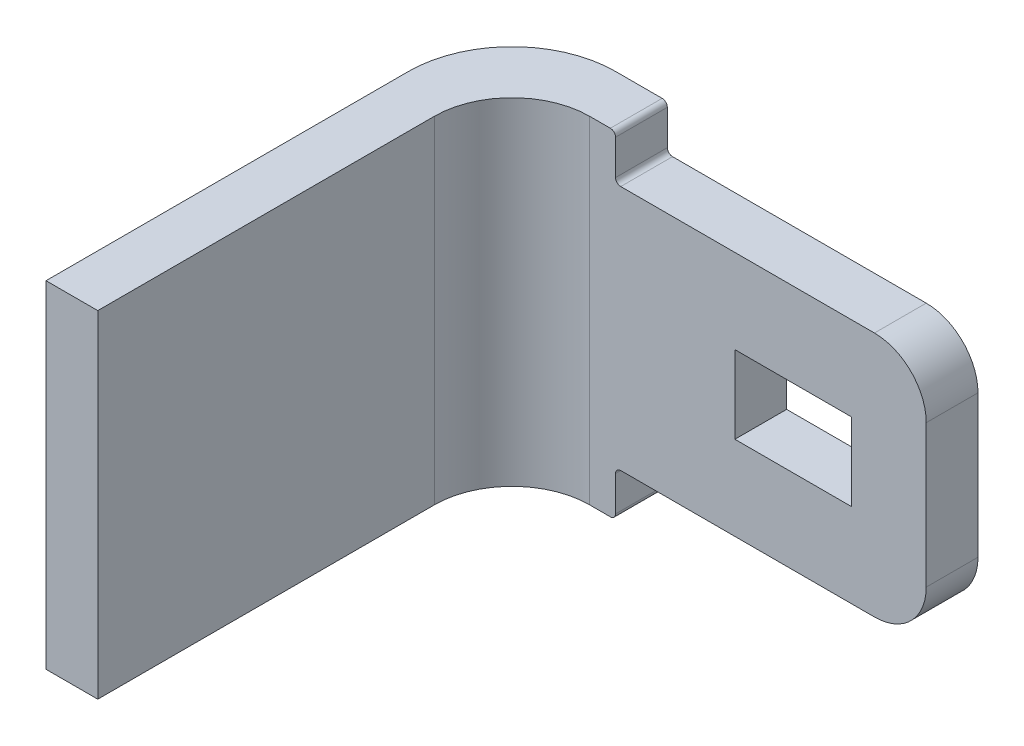
ISO-10303-21;
HEADER;
FILE_DESCRIPTION(('STEP AP214'),'2;1');
FILE_NAME('part.step','',(''),(''),'','','');
FILE_SCHEMA(('AUTOMOTIVE_DESIGN { 1 0 10303 214 1 1 1 1 }'));
ENDSEC;
DATA;
#1=APPLICATION_CONTEXT('core data for automotive mechanical design processes');
#2=APPLICATION_PROTOCOL_DEFINITION('international standard','automotive_design',2000,#1);
#3=PRODUCT_CONTEXT('',#1,'mechanical');
#4=PRODUCT('Part','Part','',(#3));
#5=PRODUCT_RELATED_PRODUCT_CATEGORY('part','',(#4));
#6=PRODUCT_DEFINITION_FORMATION('','',#4);
#7=PRODUCT_DEFINITION_CONTEXT('part definition',#1,'design');
#8=PRODUCT_DEFINITION('design','',#6,#7);
#9=PRODUCT_DEFINITION_SHAPE('','',#8);
#10=(LENGTH_UNIT() NAMED_UNIT(*) SI_UNIT(.MILLI.,.METRE.));
#11=(NAMED_UNIT(*) PLANE_ANGLE_UNIT() SI_UNIT($,.RADIAN.));
#12=(NAMED_UNIT(*) SI_UNIT($,.STERADIAN.) SOLID_ANGLE_UNIT());
#13=UNCERTAINTY_MEASURE_WITH_UNIT(LENGTH_MEASURE(1.E-05),#10,'distance_accuracy_value','');
#14=(GEOMETRIC_REPRESENTATION_CONTEXT(3) GLOBAL_UNCERTAINTY_ASSIGNED_CONTEXT((#13)) GLOBAL_UNIT_ASSIGNED_CONTEXT((#10,
#11,#12)) REPRESENTATION_CONTEXT('',''));
#15=CARTESIAN_POINT('',(0.,0.,0.));
#16=DIRECTION('',(0.,0.,1.));
#17=DIRECTION('',(1.,0.,0.));
#18=AXIS2_PLACEMENT_3D('',#15,#16,#17);
#19=CARTESIAN_POINT('',(-22.7024644194488,6.5,-9.));
#20=DIRECTION('',(1.,0.,0.));
#21=DIRECTION('',(0.,0.,-1.));
#22=AXIS2_PLACEMENT_3D('',#19,#20,#21);
#23=PLANE('',#22);
#24=DIRECTION('',(0.,0.,1.));
#25=VECTOR('',#24,1.);
#26=CARTESIAN_POINT('',(-22.7024644194488,6.5,-9.));
#27=LINE('',#26,#25);
#28=CARTESIAN_POINT('',(-22.7024644194488,6.5,-7.));
#29=VERTEX_POINT('',#28);
#30=CARTESIAN_POINT('',(-22.7024644194488,6.5,0.));
#31=VERTEX_POINT('',#30);
#32=EDGE_CURVE('E241',#29,#31,#27,.T.);
#33=ORIENTED_EDGE('',*,*,#32,.F.);
#34=DIRECTION('',(0.,-1.,0.));
#35=VECTOR('',#34,1.);
#36=CARTESIAN_POINT('',(-22.7024644194488,6.5,-7.));
#37=LINE('',#36,#35);
#38=CARTESIAN_POINT('',(-22.7024644194488,0.,-7.));
#39=VERTEX_POINT('',#38);
#40=EDGE_CURVE('E276',#29,#39,#37,.T.);
#41=ORIENTED_EDGE('',*,*,#40,.T.);
#42=DIRECTION('',(0.,0.,1.));
#43=VECTOR('',#42,1.);
#44=CARTESIAN_POINT('',(-22.7024644194488,0.,-9.));
#45=LINE('',#44,#43);
#46=CARTESIAN_POINT('',(-22.7024644194488,0.,0.));
#47=VERTEX_POINT('',#46);
#48=EDGE_CURVE('E240',#39,#47,#45,.T.);
#49=ORIENTED_EDGE('',*,*,#48,.T.);
#50=DIRECTION('',(0.,-1.,0.));
#51=VECTOR('',#50,1.);
#52=CARTESIAN_POINT('',(-22.7024644194488,6.5,0.));
#53=LINE('',#52,#51);
#54=EDGE_CURVE('E273',#31,#47,#53,.T.);
#55=ORIENTED_EDGE('',*,*,#54,.F.);
#56=EDGE_LOOP('',(#33,#41,#49,#55));
#57=FACE_BOUND('',#56,.T.);
#58=ADVANCED_FACE('F35',(#57),#23,.F.);
#59=CARTESIAN_POINT('',(-22.7024644194488,6.5,0.));
#60=DIRECTION('',(0.,0.,-1.));
#61=DIRECTION('',(-1.,0.,0.));
#62=AXIS2_PLACEMENT_3D('',#59,#60,#61);
#63=PLANE('',#62);
#64=DIRECTION('',(1.,0.,0.));
#65=VECTOR('',#64,1.);
#66=CARTESIAN_POINT('',(-22.7024644194488,0.,0.));
#67=LINE('',#66,#65);
#68=CARTESIAN_POINT('',(-21.7024644194488,0.,0.));
#69=VERTEX_POINT('',#68);
#70=EDGE_CURVE('E256',#47,#69,#67,.T.);
#71=ORIENTED_EDGE('',*,*,#70,.T.);
#72=DIRECTION('',(0.,-1.,0.));
#73=VECTOR('',#72,1.);
#74=CARTESIAN_POINT('',(-21.7024644194488,6.5,0.));
#75=LINE('',#74,#73);
#76=CARTESIAN_POINT('',(-21.7024644194488,6.5,0.));
#77=VERTEX_POINT('',#76);
#78=EDGE_CURVE('E270',#77,#69,#75,.T.);
#79=ORIENTED_EDGE('',*,*,#78,.F.);
#80=DIRECTION('',(1.,0.,0.));
#81=VECTOR('',#80,1.);
#82=CARTESIAN_POINT('',(-22.7024644194488,6.5,0.));
#83=LINE('',#82,#81);
#84=EDGE_CURVE('E243',#31,#77,#83,.T.);
#85=ORIENTED_EDGE('',*,*,#84,.F.);
#86=ORIENTED_EDGE('',*,*,#54,.T.);
#87=EDGE_LOOP('',(#71,#79,#85,#86));
#88=FACE_BOUND('',#87,.T.);
#89=ADVANCED_FACE('F427',(#88),#63,.F.);
#90=CARTESIAN_POINT('',(-21.7024644194488,6.5,0.));
#91=DIRECTION('',(-1.,0.,0.));
#92=DIRECTION('',(0.,0.,1.));
#93=AXIS2_PLACEMENT_3D('',#90,#91,#92);
#94=PLANE('',#93);
#95=DIRECTION('',(0.,0.,-1.));
#96=VECTOR('',#95,1.);
#97=CARTESIAN_POINT('',(-21.7024644194488,0.,0.));
#98=LINE('',#97,#96);
#99=CARTESIAN_POINT('',(-21.7024644194488,0.,-6.50000000000001));
#100=VERTEX_POINT('',#99);
#101=EDGE_CURVE('E258',#69,#100,#98,.T.);
#102=ORIENTED_EDGE('',*,*,#101,.T.);
#103=DIRECTION('',(0.,-1.,0.));
#104=VECTOR('',#103,1.);
#105=CARTESIAN_POINT('',(-21.7024644194488,6.5,-6.50000000000001));
#106=LINE('',#105,#104);
#107=CARTESIAN_POINT('',(-21.7024644194488,6.5,-6.50000000000001));
#108=VERTEX_POINT('',#107);
#109=EDGE_CURVE('E290',#100,#108,#106,.F.);
#110=ORIENTED_EDGE('',*,*,#109,.T.);
#111=DIRECTION('',(0.,0.,-1.));
#112=VECTOR('',#111,1.);
#113=CARTESIAN_POINT('',(-21.7024644194488,6.5,0.));
#114=LINE('',#113,#112);
#115=EDGE_CURVE('E246',#77,#108,#114,.T.);
#116=ORIENTED_EDGE('',*,*,#115,.F.);
#117=ORIENTED_EDGE('',*,*,#78,.T.);
#118=EDGE_LOOP('',(#102,#110,#116,#117));
#119=FACE_BOUND('',#118,.T.);
#120=ADVANCED_FACE('F430',(#119),#94,.F.);
#121=CARTESIAN_POINT('',(-21.7024644194488,6.5,-8.00000000000001));
#122=DIRECTION('',(0.,0.,-1.));
#123=DIRECTION('',(-1.,0.,0.));
#124=AXIS2_PLACEMENT_3D('',#121,#122,#123);
#125=PLANE('',#124);
#126=DIRECTION('',(1.,0.,0.));
#127=VECTOR('',#126,1.);
#128=CARTESIAN_POINT('',(-21.7024644194488,4.,-8.00000000000001));
#129=LINE('',#128,#127);
#130=CARTESIAN_POINT('',(-17.3980030466757,4.,-8.00000000000001));
#131=VERTEX_POINT('',#130);
#132=CARTESIAN_POINT('',(-15.1480030466757,4.,-8.00000000000001));
#133=VERTEX_POINT('',#132);
#134=EDGE_CURVE('E214',#131,#133,#129,.T.);
#135=ORIENTED_EDGE('',*,*,#134,.T.);
#136=DIRECTION('',(0.,-1.,0.));
#137=VECTOR('',#136,1.);
#138=CARTESIAN_POINT('',(-15.1480030466757,6.5,-8.00000000000001));
#139=LINE('',#138,#137);
#140=CARTESIAN_POINT('',(-15.1480030466757,2.5,-8.00000000000001));
#141=VERTEX_POINT('',#140);
#142=EDGE_CURVE('E217',#133,#141,#139,.T.);
#143=ORIENTED_EDGE('',*,*,#142,.T.);
#144=DIRECTION('',(-1.,0.,0.));
#145=VECTOR('',#144,1.);
#146=CARTESIAN_POINT('',(-21.7024644194488,2.5,-8.00000000000001));
#147=LINE('',#146,#145);
#148=CARTESIAN_POINT('',(-17.3980030466758,2.5,-8.00000000000001));
#149=VERTEX_POINT('',#148);
#150=EDGE_CURVE('E209',#141,#149,#147,.T.);
#151=ORIENTED_EDGE('',*,*,#150,.T.);
#152=DIRECTION('',(0.,1.,0.));
#153=VECTOR('',#152,1.);
#154=CARTESIAN_POINT('',(-17.3980030466757,6.5,-8.00000000000001));
#155=LINE('',#154,#153);
#156=EDGE_CURVE('E189',#149,#131,#155,.T.);
#157=ORIENTED_EDGE('',*,*,#156,.T.);
#158=EDGE_LOOP('',(#135,#143,#151,#157));
#159=FACE_BOUND('',#158,.T.);
#160=DIRECTION('',(-1.,0.,0.));
#161=VECTOR('',#160,1.);
#162=CARTESIAN_POINT('',(-21.7024644194488,5.625,-8.00000000000001));
#163=LINE('',#162,#161);
#164=CARTESIAN_POINT('',(-14.7024644194488,5.625,-8.00000000000001));
#165=VERTEX_POINT('',#164);
#166=CARTESIAN_POINT('',(-19.6024644194488,5.625,-8.00000000000001));
#167=VERTEX_POINT('',#166);
#168=EDGE_CURVE('E227',#165,#167,#163,.T.);
#169=ORIENTED_EDGE('',*,*,#168,.T.);
#170=CARTESIAN_POINT('',(-19.6024644194488,5.725,-8.00000000000001));
#171=DIRECTION('',(0.,0.,-1.));
#172=DIRECTION('',(-1.,0.,0.));
#173=AXIS2_PLACEMENT_3D('',#170,#171,#172);
#174=CIRCLE('',#173,0.1);
#175=CARTESIAN_POINT('',(-19.7024644194488,5.725,-8.00000000000001));
#176=VERTEX_POINT('',#175);
#177=EDGE_CURVE('E11',#167,#176,#174,.T.);
#178=ORIENTED_EDGE('',*,*,#177,.T.);
#179=DIRECTION('',(0.,1.,0.));
#180=VECTOR('',#179,1.);
#181=CARTESIAN_POINT('',(-19.7024644194488,6.5,-8.00000000000001));
#182=LINE('',#181,#180);
#183=CARTESIAN_POINT('',(-19.7024644194488,6.4,-8.00000000000001));
#184=VERTEX_POINT('',#183);
#185=EDGE_CURVE('E225',#176,#184,#182,.T.);
#186=ORIENTED_EDGE('',*,*,#185,.T.);
#187=CARTESIAN_POINT('',(-19.8024644194488,6.4,-8.00000000000001));
#188=DIRECTION('',(0.,0.,-1.));
#189=DIRECTION('',(-1.,0.,0.));
#190=AXIS2_PLACEMENT_3D('',#187,#188,#189);
#191=CIRCLE('',#190,0.1);
#192=CARTESIAN_POINT('',(-19.8024644194488,6.5,-8.00000000000001));
#193=VERTEX_POINT('',#192);
#194=EDGE_CURVE('E321',#184,#193,#191,.F.);
#195=ORIENTED_EDGE('',*,*,#194,.T.);
#196=DIRECTION('',(1.,0.,0.));
#197=VECTOR('',#196,1.);
#198=CARTESIAN_POINT('',(-21.7024644194488,6.5,-8.00000000000001));
#199=LINE('',#198,#197);
#200=CARTESIAN_POINT('',(-20.2024644194488,6.5,-8.00000000000001));
#201=VERTEX_POINT('',#200);
#202=EDGE_CURVE('E249',#201,#193,#199,.T.);
#203=ORIENTED_EDGE('',*,*,#202,.F.);
#204=DIRECTION('',(0.,-1.,0.));
#205=VECTOR('',#204,1.);
#206=CARTESIAN_POINT('',(-20.2024644194488,0.,-8.00000000000001));
#207=LINE('',#206,#205);
#208=CARTESIAN_POINT('',(-20.2024644194488,0.,-8.00000000000001));
#209=VERTEX_POINT('',#208);
#210=EDGE_CURVE('E287',#201,#209,#207,.T.);
#211=ORIENTED_EDGE('',*,*,#210,.T.);
#212=DIRECTION('',(1.,0.,0.));
#213=VECTOR('',#212,1.);
#214=CARTESIAN_POINT('',(-21.7024644194488,0.,-8.00000000000001));
#215=LINE('',#214,#213);
#216=CARTESIAN_POINT('',(-19.8024644194488,0.,-8.00000000000001));
#217=VERTEX_POINT('',#216);
#218=EDGE_CURVE('E261',#209,#217,#215,.T.);
#219=ORIENTED_EDGE('',*,*,#218,.T.);
#220=CARTESIAN_POINT('',(-19.8024644194488,0.1,-8.00000000000001));
#221=DIRECTION('',(0.,0.,-1.));
#222=DIRECTION('',(-1.,0.,0.));
#223=AXIS2_PLACEMENT_3D('',#220,#221,#222);
#224=CIRCLE('',#223,0.1);
#225=CARTESIAN_POINT('',(-19.7024644194488,0.1,-8.00000000000001));
#226=VERTEX_POINT('',#225);
#227=EDGE_CURVE('E319',#217,#226,#224,.F.);
#228=ORIENTED_EDGE('',*,*,#227,.T.);
#229=DIRECTION('',(0.,1.,0.));
#230=VECTOR('',#229,1.);
#231=CARTESIAN_POINT('',(-19.7024644194488,6.5,-8.00000000000001));
#232=LINE('',#231,#230);
#233=CARTESIAN_POINT('',(-19.7024644194488,0.775,-8.00000000000001));
#234=VERTEX_POINT('',#233);
#235=EDGE_CURVE('E235',#226,#234,#232,.T.);
#236=ORIENTED_EDGE('',*,*,#235,.T.);
#237=CARTESIAN_POINT('',(-19.6024644194488,0.775,-8.00000000000001));
#238=DIRECTION('',(0.,0.,-1.));
#239=DIRECTION('',(-1.,0.,0.));
#240=AXIS2_PLACEMENT_3D('',#237,#238,#239);
#241=CIRCLE('',#240,0.1);
#242=CARTESIAN_POINT('',(-19.6024644194488,0.875,-8.00000000000001));
#243=VERTEX_POINT('',#242);
#244=EDGE_CURVE('E347',#234,#243,#241,.T.);
#245=ORIENTED_EDGE('',*,*,#244,.T.);
#246=DIRECTION('',(1.,0.,0.));
#247=VECTOR('',#246,1.);
#248=CARTESIAN_POINT('',(-21.7024644194488,0.875,-8.00000000000001));
#249=LINE('',#248,#247);
#250=CARTESIAN_POINT('',(-14.7024644194488,0.875,-8.00000000000001));
#251=VERTEX_POINT('',#250);
#252=EDGE_CURVE('E238',#243,#251,#249,.T.);
#253=ORIENTED_EDGE('',*,*,#252,.T.);
#254=CARTESIAN_POINT('',(-14.7024644194488,1.875,-8.00000000000001));
#255=DIRECTION('',(0.,0.,-1.));
#256=DIRECTION('',(-1.,0.,0.));
#257=AXIS2_PLACEMENT_3D('',#254,#255,#256);
#258=CIRCLE('',#257,1.);
#259=CARTESIAN_POINT('',(-13.7024644194488,1.875,-8.00000000000001));
#260=VERTEX_POINT('',#259);
#261=EDGE_CURVE('E309',#251,#260,#258,.F.);
#262=ORIENTED_EDGE('',*,*,#261,.T.);
#263=DIRECTION('',(0.,-1.,0.));
#264=VECTOR('',#263,1.);
#265=CARTESIAN_POINT('',(-13.7024644194488,6.5,-8.00000000000001));
#266=LINE('',#265,#264);
#267=CARTESIAN_POINT('',(-13.7024644194488,4.625,-8.00000000000001));
#268=VERTEX_POINT('',#267);
#269=EDGE_CURVE('E267',#268,#260,#266,.T.);
#270=ORIENTED_EDGE('',*,*,#269,.F.);
#271=CARTESIAN_POINT('',(-14.7024644194488,4.625,-8.00000000000001));
#272=DIRECTION('',(0.,0.,-1.));
#273=DIRECTION('',(-1.,0.,0.));
#274=AXIS2_PLACEMENT_3D('',#271,#272,#273);
#275=CIRCLE('',#274,1.);
#276=EDGE_CURVE('E311',#268,#165,#275,.F.);
#277=ORIENTED_EDGE('',*,*,#276,.T.);
#278=EDGE_LOOP('',(#169,#178,#186,#195,#203,#211,#219,#228,#236,#245,#253,#262,#270,#277));
#279=FACE_BOUND('',#278,.T.);
#280=ADVANCED_FACE('F361',(#159,#279),#125,.F.);
#281=CARTESIAN_POINT('',(-13.7024644194488,6.5,-8.00000000000001));
#282=DIRECTION('',(-1.,0.,0.));
#283=DIRECTION('',(0.,0.,1.));
#284=AXIS2_PLACEMENT_3D('',#281,#282,#283);
#285=PLANE('',#284);
#286=DIRECTION('',(0.,-1.,0.));
#287=VECTOR('',#286,1.);
#288=CARTESIAN_POINT('',(-13.7024644194488,6.5,-9.00000000000001));
#289=LINE('',#288,#287);
#290=CARTESIAN_POINT('',(-13.7024644194488,4.625,-9.00000000000001));
#291=VERTEX_POINT('',#290);
#292=CARTESIAN_POINT('',(-13.7024644194488,1.875,-9.00000000000001));
#293=VERTEX_POINT('',#292);
#294=EDGE_CURVE('E254',#291,#293,#289,.T.);
#295=ORIENTED_EDGE('',*,*,#294,.F.);
#296=DIRECTION('',(0.,0.,-1.));
#297=VECTOR('',#296,1.);
#298=CARTESIAN_POINT('',(-13.7024644194488,4.625,-8.00000000000001));
#299=LINE('',#298,#297);
#300=EDGE_CURVE('E307',#291,#268,#299,.F.);
#301=ORIENTED_EDGE('',*,*,#300,.T.);
#302=ORIENTED_EDGE('',*,*,#269,.T.);
#303=DIRECTION('',(0.,0.,-1.));
#304=VECTOR('',#303,1.);
#305=CARTESIAN_POINT('',(-13.7024644194488,1.875,-8.00000000000001));
#306=LINE('',#305,#304);
#307=EDGE_CURVE('E304',#260,#293,#306,.T.);
#308=ORIENTED_EDGE('',*,*,#307,.T.);
#309=EDGE_LOOP('',(#295,#301,#302,#308));
#310=FACE_BOUND('',#309,.T.);
#311=ADVANCED_FACE('F411',(#310),#285,.F.);
#312=CARTESIAN_POINT('',(-13.7024644194488,6.5,-9.00000000000001));
#313=DIRECTION('',(0.,0.,1.));
#314=DIRECTION('',(1.,0.,0.));
#315=AXIS2_PLACEMENT_3D('',#312,#313,#314);
#316=PLANE('',#315);
#317=DIRECTION('',(-1.,0.,0.));
#318=VECTOR('',#317,1.);
#319=CARTESIAN_POINT('',(-15.1480030466757,2.5,-9.00000000000001));
#320=LINE('',#319,#318);
#321=CARTESIAN_POINT('',(-15.1480030466757,2.5,-9.00000000000001));
#322=VERTEX_POINT('',#321);
#323=CARTESIAN_POINT('',(-17.3980030466757,2.5,-9.00000000000001));
#324=VERTEX_POINT('',#323);
#325=EDGE_CURVE('E195',#322,#324,#320,.T.);
#326=ORIENTED_EDGE('',*,*,#325,.F.);
#327=DIRECTION('',(0.,-1.,0.));
#328=VECTOR('',#327,1.);
#329=CARTESIAN_POINT('',(-15.1480030466757,2.5,-9.00000000000001));
#330=LINE('',#329,#328);
#331=CARTESIAN_POINT('',(-15.1480030466757,4.,-9.00000000000001));
#332=VERTEX_POINT('',#331);
#333=EDGE_CURVE('E58',#332,#322,#330,.T.);
#334=ORIENTED_EDGE('',*,*,#333,.F.);
#335=DIRECTION('',(1.,0.,0.));
#336=VECTOR('',#335,1.);
#337=CARTESIAN_POINT('',(-15.1480030466757,4.,-9.00000000000001));
#338=LINE('',#337,#336);
#339=CARTESIAN_POINT('',(-17.3980030466757,4.,-9.00000000000001));
#340=VERTEX_POINT('',#339);
#341=EDGE_CURVE('E202',#340,#332,#338,.T.);
#342=ORIENTED_EDGE('',*,*,#341,.F.);
#343=DIRECTION('',(0.,1.,0.));
#344=VECTOR('',#343,1.);
#345=CARTESIAN_POINT('',(-17.3980030466757,2.5,-9.00000000000001));
#346=LINE('',#345,#344);
#347=EDGE_CURVE('E186',#324,#340,#346,.T.);
#348=ORIENTED_EDGE('',*,*,#347,.F.);
#349=EDGE_LOOP('',(#326,#334,#342,#348));
#350=FACE_BOUND('',#349,.T.);
#351=DIRECTION('',(-1.,0.,0.));
#352=VECTOR('',#351,1.);
#353=CARTESIAN_POINT('',(-13.7024644194488,6.5,-9.00000000000001));
#354=LINE('',#353,#352);
#355=CARTESIAN_POINT('',(-19.8024644194488,6.5,-9.));
#356=VERTEX_POINT('',#355);
#357=CARTESIAN_POINT('',(-20.7024644194488,6.5,-9.));
#358=VERTEX_POINT('',#357);
#359=EDGE_CURVE('E252',#356,#358,#354,.T.);
#360=ORIENTED_EDGE('',*,*,#359,.F.);
#361=CARTESIAN_POINT('',(-19.8024644194488,6.4,-9.));
#362=DIRECTION('',(0.,0.,1.));
#363=DIRECTION('',(1.,0.,0.));
#364=AXIS2_PLACEMENT_3D('',#361,#362,#363);
#365=CIRCLE('',#364,0.1);
#366=CARTESIAN_POINT('',(-19.7024644194488,6.4,-9.));
#367=VERTEX_POINT('',#366);
#368=EDGE_CURVE('E327',#356,#367,#365,.F.);
#369=ORIENTED_EDGE('',*,*,#368,.T.);
#370=DIRECTION('',(0.,1.,0.));
#371=VECTOR('',#370,1.);
#372=CARTESIAN_POINT('',(-19.7024644194488,6.5,-9.));
#373=LINE('',#372,#371);
#374=CARTESIAN_POINT('',(-19.7024644194488,5.725,-9.));
#375=VERTEX_POINT('',#374);
#376=EDGE_CURVE('E223',#375,#367,#373,.T.);
#377=ORIENTED_EDGE('',*,*,#376,.F.);
#378=CARTESIAN_POINT('',(-19.6024644194488,5.725,-9.));
#379=DIRECTION('',(0.,0.,1.));
#380=DIRECTION('',(1.,0.,0.));
#381=AXIS2_PLACEMENT_3D('',#378,#379,#380);
#382=CIRCLE('',#381,0.1);
#383=CARTESIAN_POINT('',(-19.6024644194488,5.625,-9.));
#384=VERTEX_POINT('',#383);
#385=EDGE_CURVE('E43',#375,#384,#382,.T.);
#386=ORIENTED_EDGE('',*,*,#385,.T.);
#387=DIRECTION('',(-1.,0.,0.));
#388=VECTOR('',#387,1.);
#389=CARTESIAN_POINT('',(-13.7024644194488,5.625,-9.00000000000001));
#390=LINE('',#389,#388);
#391=CARTESIAN_POINT('',(-14.7024644194488,5.625,-9.00000000000001));
#392=VERTEX_POINT('',#391);
#393=EDGE_CURVE('E220',#392,#384,#390,.T.);
#394=ORIENTED_EDGE('',*,*,#393,.F.);
#395=CARTESIAN_POINT('',(-14.7024644194488,4.625,-9.00000000000001));
#396=DIRECTION('',(0.,0.,1.));
#397=DIRECTION('',(1.,0.,0.));
#398=AXIS2_PLACEMENT_3D('',#395,#396,#397);
#399=CIRCLE('',#398,1.);
#400=EDGE_CURVE('E302',#392,#291,#399,.F.);
#401=ORIENTED_EDGE('',*,*,#400,.T.);
#402=ORIENTED_EDGE('',*,*,#294,.T.);
#403=CARTESIAN_POINT('',(-14.7024644194488,1.875,-9.00000000000001));
#404=DIRECTION('',(0.,0.,1.));
#405=DIRECTION('',(1.,0.,0.));
#406=AXIS2_PLACEMENT_3D('',#403,#404,#405);
#407=CIRCLE('',#406,1.);
#408=CARTESIAN_POINT('',(-14.7024644194488,0.875,-9.00000000000001));
#409=VERTEX_POINT('',#408);
#410=EDGE_CURVE('E299',#293,#409,#407,.F.);
#411=ORIENTED_EDGE('',*,*,#410,.T.);
#412=DIRECTION('',(1.,0.,0.));
#413=VECTOR('',#412,1.);
#414=CARTESIAN_POINT('',(-13.7024644194488,0.875,-9.00000000000001));
#415=LINE('',#414,#413);
#416=CARTESIAN_POINT('',(-19.6024644194488,0.875,-9.));
#417=VERTEX_POINT('',#416);
#418=EDGE_CURVE('E233',#417,#409,#415,.T.);
#419=ORIENTED_EDGE('',*,*,#418,.F.);
#420=CARTESIAN_POINT('',(-19.6024644194488,0.775,-9.));
#421=DIRECTION('',(0.,0.,1.));
#422=DIRECTION('',(1.,0.,0.));
#423=AXIS2_PLACEMENT_3D('',#420,#421,#422);
#424=CIRCLE('',#423,0.1);
#425=CARTESIAN_POINT('',(-19.7024644194488,0.775,-9.));
#426=VERTEX_POINT('',#425);
#427=EDGE_CURVE('E345',#417,#426,#424,.T.);
#428=ORIENTED_EDGE('',*,*,#427,.T.);
#429=DIRECTION('',(0.,1.,0.));
#430=VECTOR('',#429,1.);
#431=CARTESIAN_POINT('',(-19.7024644194488,0.,-9.));
#432=LINE('',#431,#430);
#433=CARTESIAN_POINT('',(-19.7024644194488,0.1,-9.));
#434=VERTEX_POINT('',#433);
#435=EDGE_CURVE('E230',#434,#426,#432,.T.);
#436=ORIENTED_EDGE('',*,*,#435,.F.);
#437=CARTESIAN_POINT('',(-19.8024644194488,0.1,-9.));
#438=DIRECTION('',(0.,0.,1.));
#439=DIRECTION('',(1.,0.,0.));
#440=AXIS2_PLACEMENT_3D('',#437,#438,#439);
#441=CIRCLE('',#440,0.1);
#442=CARTESIAN_POINT('',(-19.8024644194488,0.,-9.));
#443=VERTEX_POINT('',#442);
#444=EDGE_CURVE('E325',#434,#443,#441,.F.);
#445=ORIENTED_EDGE('',*,*,#444,.T.);
#446=DIRECTION('',(-1.,0.,0.));
#447=VECTOR('',#446,1.);
#448=CARTESIAN_POINT('',(-13.7024644194488,0.,-9.00000000000001));
#449=LINE('',#448,#447);
#450=CARTESIAN_POINT('',(-20.7024644194488,0.,-9.));
#451=VERTEX_POINT('',#450);
#452=EDGE_CURVE('E244',#443,#451,#449,.T.);
#453=ORIENTED_EDGE('',*,*,#452,.T.);
#454=DIRECTION('',(0.,-1.,0.));
#455=VECTOR('',#454,1.);
#456=CARTESIAN_POINT('',(-20.7024644194488,6.5,-9.));
#457=LINE('',#456,#455);
#458=EDGE_CURVE('E282',#451,#358,#457,.F.);
#459=ORIENTED_EDGE('',*,*,#458,.T.);
#460=EDGE_LOOP('',(#360,#369,#377,#386,#394,#401,#402,#411,#419,#428,#436,#445,#453,#459));
#461=FACE_BOUND('',#460,.T.);
#462=ADVANCED_FACE('F199',(#350,#461),#316,.F.);
#463=CARTESIAN_POINT('',(0.,6.5,0.));
#464=DIRECTION('',(0.,1.,0.));
#465=DIRECTION('',(0.,0.,1.));
#466=AXIS2_PLACEMENT_3D('',#463,#464,#465);
#467=PLANE('',#466);
#468=ORIENTED_EDGE('',*,*,#202,.T.);
#469=DIRECTION('',(0.,0.,1.));
#470=VECTOR('',#469,1.);
#471=CARTESIAN_POINT('',(-19.8024644194488,6.5,-9.));
#472=LINE('',#471,#470);
#473=EDGE_CURVE('E323',#193,#356,#472,.F.);
#474=ORIENTED_EDGE('',*,*,#473,.T.);
#475=ORIENTED_EDGE('',*,*,#359,.T.);
#476=CARTESIAN_POINT('',(-20.7024644194488,6.5,-7.));
#477=DIRECTION('',(0.,1.,0.));
#478=DIRECTION('',(0.,0.,1.));
#479=AXIS2_PLACEMENT_3D('',#476,#477,#478);
#480=CIRCLE('',#479,2.);
#481=EDGE_CURVE('E285',#358,#29,#480,.T.);
#482=ORIENTED_EDGE('',*,*,#481,.T.);
#483=ORIENTED_EDGE('',*,*,#32,.T.);
#484=ORIENTED_EDGE('',*,*,#84,.T.);
#485=ORIENTED_EDGE('',*,*,#115,.T.);
#486=CARTESIAN_POINT('',(-20.2024644194488,6.5,-6.50000000000001));
#487=DIRECTION('',(0.,1.,0.));
#488=DIRECTION('',(0.,0.,1.));
#489=AXIS2_PLACEMENT_3D('',#486,#487,#488);
#490=CIRCLE('',#489,1.5);
#491=EDGE_CURVE('E294',#108,#201,#490,.F.);
#492=ORIENTED_EDGE('',*,*,#491,.T.);
#493=EDGE_LOOP('',(#468,#474,#475,#482,#483,#484,#485,#492));
#494=FACE_BOUND('',#493,.T.);
#495=ADVANCED_FACE('F373',(#494),#467,.T.);
#496=CARTESIAN_POINT('',(0.,0.,0.));
#497=DIRECTION('',(0.,1.,0.));
#498=DIRECTION('',(0.,0.,1.));
#499=AXIS2_PLACEMENT_3D('',#496,#497,#498);
#500=PLANE('',#499);
#501=ORIENTED_EDGE('',*,*,#452,.F.);
#502=DIRECTION('',(0.,0.,1.));
#503=VECTOR('',#502,1.);
#504=CARTESIAN_POINT('',(-19.8024644194488,0.,0.));
#505=LINE('',#504,#503);
#506=EDGE_CURVE('E330',#443,#217,#505,.T.);
#507=ORIENTED_EDGE('',*,*,#506,.T.);
#508=ORIENTED_EDGE('',*,*,#218,.F.);
#509=CARTESIAN_POINT('',(-20.2024644194488,0.,-6.50000000000001));
#510=DIRECTION('',(0.,1.,0.));
#511=DIRECTION('',(0.,0.,1.));
#512=AXIS2_PLACEMENT_3D('',#509,#510,#511);
#513=CIRCLE('',#512,1.5);
#514=EDGE_CURVE('E292',#209,#100,#513,.T.);
#515=ORIENTED_EDGE('',*,*,#514,.T.);
#516=ORIENTED_EDGE('',*,*,#101,.F.);
#517=ORIENTED_EDGE('',*,*,#70,.F.);
#518=ORIENTED_EDGE('',*,*,#48,.F.);
#519=CARTESIAN_POINT('',(-20.7024644194488,0.,-7.));
#520=DIRECTION('',(0.,1.,0.));
#521=DIRECTION('',(0.,0.,1.));
#522=AXIS2_PLACEMENT_3D('',#519,#520,#521);
#523=CIRCLE('',#522,2.);
#524=EDGE_CURVE('E279',#39,#451,#523,.F.);
#525=ORIENTED_EDGE('',*,*,#524,.T.);
#526=EDGE_LOOP('',(#501,#507,#508,#515,#516,#517,#518,#525));
#527=FACE_BOUND('',#526,.T.);
#528=ADVANCED_FACE('F382',(#527),#500,.F.);
#529=CARTESIAN_POINT('',(-20.7024644194488,6.5,-7.));
#530=DIRECTION('',(0.,-1.,0.));
#531=DIRECTION('',(0.,0.,-1.));
#532=AXIS2_PLACEMENT_3D('',#529,#530,#531);
#533=CYLINDRICAL_SURFACE('',#532,2.);
#534=ORIENTED_EDGE('',*,*,#481,.F.);
#535=ORIENTED_EDGE('',*,*,#458,.F.);
#536=ORIENTED_EDGE('',*,*,#524,.F.);
#537=ORIENTED_EDGE('',*,*,#40,.F.);
#538=EDGE_LOOP('',(#534,#535,#536,#537));
#539=FACE_BOUND('',#538,.T.);
#540=ADVANCED_FACE('F421',(#539),#533,.T.);
#541=CARTESIAN_POINT('',(-20.2024644194488,6.5,-6.50000000000001));
#542=DIRECTION('',(0.,1.,0.));
#543=DIRECTION('',(0.,0.,1.));
#544=AXIS2_PLACEMENT_3D('',#541,#542,#543);
#545=CYLINDRICAL_SURFACE('',#544,1.5);
#546=ORIENTED_EDGE('',*,*,#491,.F.);
#547=ORIENTED_EDGE('',*,*,#109,.F.);
#548=ORIENTED_EDGE('',*,*,#514,.F.);
#549=ORIENTED_EDGE('',*,*,#210,.F.);
#550=EDGE_LOOP('',(#546,#547,#548,#549));
#551=FACE_BOUND('',#550,.T.);
#552=ADVANCED_FACE('F378',(#551),#545,.F.);
#553=CARTESIAN_POINT('',(-13.7024644194488,0.875,0.));
#554=DIRECTION('',(0.,1.,0.));
#555=DIRECTION('',(-1.,0.,0.));
#556=AXIS2_PLACEMENT_3D('',#553,#554,#555);
#557=PLANE('',#556);
#558=ORIENTED_EDGE('',*,*,#252,.F.);
#559=DIRECTION('',(0.,0.,-1.));
#560=VECTOR('',#559,1.);
#561=CARTESIAN_POINT('',(-19.6024644194488,0.875,-9.));
#562=LINE('',#561,#560);
#563=EDGE_CURVE('E335',#243,#417,#562,.T.);
#564=ORIENTED_EDGE('',*,*,#563,.T.);
#565=ORIENTED_EDGE('',*,*,#418,.T.);
#566=DIRECTION('',(0.,0.,-1.));
#567=VECTOR('',#566,1.);
#568=CARTESIAN_POINT('',(-14.7024644194488,0.875,0.));
#569=LINE('',#568,#567);
#570=EDGE_CURVE('E313',#409,#251,#569,.F.);
#571=ORIENTED_EDGE('',*,*,#570,.T.);
#572=EDGE_LOOP('',(#558,#564,#565,#571));
#573=FACE_BOUND('',#572,.T.);
#574=ADVANCED_FACE('F400',(#573),#557,.F.);
#575=CARTESIAN_POINT('',(-19.7024644194488,0.,0.));
#576=DIRECTION('',(-1.,0.,0.));
#577=DIRECTION('',(0.,0.,1.));
#578=AXIS2_PLACEMENT_3D('',#575,#576,#577);
#579=PLANE('',#578);
#580=ORIENTED_EDGE('',*,*,#435,.T.);
#581=DIRECTION('',(0.,0.,-1.));
#582=VECTOR('',#581,1.);
#583=CARTESIAN_POINT('',(-19.7024644194488,0.775,-8.00000000000001));
#584=LINE('',#583,#582);
#585=EDGE_CURVE('E338',#426,#234,#584,.F.);
#586=ORIENTED_EDGE('',*,*,#585,.T.);
#587=ORIENTED_EDGE('',*,*,#235,.F.);
#588=DIRECTION('',(0.,0.,1.));
#589=VECTOR('',#588,1.);
#590=CARTESIAN_POINT('',(-19.7024644194488,0.1,0.));
#591=LINE('',#590,#589);
#592=EDGE_CURVE('E333',#226,#434,#591,.F.);
#593=ORIENTED_EDGE('',*,*,#592,.T.);
#594=EDGE_LOOP('',(#580,#586,#587,#593));
#595=FACE_BOUND('',#594,.T.);
#596=ADVANCED_FACE('F392',(#595),#579,.F.);
#597=CARTESIAN_POINT('',(-13.7024644194488,5.625,0.));
#598=DIRECTION('',(0.,-1.,0.));
#599=DIRECTION('',(0.,0.,-1.));
#600=AXIS2_PLACEMENT_3D('',#597,#598,#599);
#601=PLANE('',#600);
#602=ORIENTED_EDGE('',*,*,#393,.T.);
#603=DIRECTION('',(0.,0.,-1.));
#604=VECTOR('',#603,1.);
#605=CARTESIAN_POINT('',(-19.6024644194488,5.625,-8.00000000000001));
#606=LINE('',#605,#604);
#607=EDGE_CURVE('E343',#384,#167,#606,.F.);
#608=ORIENTED_EDGE('',*,*,#607,.T.);
#609=ORIENTED_EDGE('',*,*,#168,.F.);
#610=DIRECTION('',(0.,0.,-1.));
#611=VECTOR('',#610,1.);
#612=CARTESIAN_POINT('',(-14.7024644194488,5.625,0.));
#613=LINE('',#612,#611);
#614=EDGE_CURVE('E296',#165,#392,#613,.T.);
#615=ORIENTED_EDGE('',*,*,#614,.T.);
#616=EDGE_LOOP('',(#602,#608,#609,#615));
#617=FACE_BOUND('',#616,.T.);
#618=ADVANCED_FACE('F355',(#617),#601,.F.);
#619=CARTESIAN_POINT('',(-19.7024644194488,6.5,0.));
#620=DIRECTION('',(-1.,0.,0.));
#621=DIRECTION('',(0.,0.,1.));
#622=AXIS2_PLACEMENT_3D('',#619,#620,#621);
#623=PLANE('',#622);
#624=ORIENTED_EDGE('',*,*,#185,.F.);
#625=DIRECTION('',(0.,0.,-1.));
#626=VECTOR('',#625,1.);
#627=CARTESIAN_POINT('',(-19.7024644194488,5.725,-9.));
#628=LINE('',#627,#626);
#629=EDGE_CURVE('E340',#176,#375,#628,.T.);
#630=ORIENTED_EDGE('',*,*,#629,.T.);
#631=ORIENTED_EDGE('',*,*,#376,.T.);
#632=DIRECTION('',(0.,0.,1.));
#633=VECTOR('',#632,1.);
#634=CARTESIAN_POINT('',(-19.7024644194488,6.4,-8.00000000000001));
#635=LINE('',#634,#633);
#636=EDGE_CURVE('E316',#367,#184,#635,.T.);
#637=ORIENTED_EDGE('',*,*,#636,.T.);
#638=EDGE_LOOP('',(#624,#630,#631,#637));
#639=FACE_BOUND('',#638,.T.);
#640=ADVANCED_FACE('F364',(#639),#623,.F.);
#641=CARTESIAN_POINT('',(-14.7024644194488,4.625,0.));
#642=DIRECTION('',(0.,0.,-1.));
#643=DIRECTION('',(-1.,0.,0.));
#644=AXIS2_PLACEMENT_3D('',#641,#642,#643);
#645=CYLINDRICAL_SURFACE('',#644,1.);
#646=ORIENTED_EDGE('',*,*,#276,.F.);
#647=ORIENTED_EDGE('',*,*,#300,.F.);
#648=ORIENTED_EDGE('',*,*,#400,.F.);
#649=ORIENTED_EDGE('',*,*,#614,.F.);
#650=EDGE_LOOP('',(#646,#647,#648,#649));
#651=FACE_BOUND('',#650,.T.);
#652=ADVANCED_FACE('F414',(#651),#645,.T.);
#653=CARTESIAN_POINT('',(-14.7024644194488,1.875,-8.00000000000001));
#654=DIRECTION('',(0.,0.,-1.));
#655=DIRECTION('',(-1.,0.,0.));
#656=AXIS2_PLACEMENT_3D('',#653,#654,#655);
#657=CYLINDRICAL_SURFACE('',#656,1.);
#658=ORIENTED_EDGE('',*,*,#261,.F.);
#659=ORIENTED_EDGE('',*,*,#570,.F.);
#660=ORIENTED_EDGE('',*,*,#410,.F.);
#661=ORIENTED_EDGE('',*,*,#307,.F.);
#662=EDGE_LOOP('',(#658,#659,#660,#661));
#663=FACE_BOUND('',#662,.T.);
#664=ADVANCED_FACE('F406',(#663),#657,.T.);
#665=CARTESIAN_POINT('',(-19.8024644194488,6.4,0.));
#666=DIRECTION('',(0.,0.,-1.));
#667=DIRECTION('',(-1.,0.,0.));
#668=AXIS2_PLACEMENT_3D('',#665,#666,#667);
#669=CYLINDRICAL_SURFACE('',#668,0.1);
#670=ORIENTED_EDGE('',*,*,#368,.F.);
#671=ORIENTED_EDGE('',*,*,#473,.F.);
#672=ORIENTED_EDGE('',*,*,#194,.F.);
#673=ORIENTED_EDGE('',*,*,#636,.F.);
#674=EDGE_LOOP('',(#670,#671,#672,#673));
#675=FACE_BOUND('',#674,.T.);
#676=ADVANCED_FACE('F368',(#675),#669,.T.);
#677=CARTESIAN_POINT('',(-19.8024644194488,0.1,0.));
#678=DIRECTION('',(0.,0.,1.));
#679=DIRECTION('',(1.,0.,0.));
#680=AXIS2_PLACEMENT_3D('',#677,#678,#679);
#681=CYLINDRICAL_SURFACE('',#680,0.1);
#682=ORIENTED_EDGE('',*,*,#444,.F.);
#683=ORIENTED_EDGE('',*,*,#592,.F.);
#684=ORIENTED_EDGE('',*,*,#227,.F.);
#685=ORIENTED_EDGE('',*,*,#506,.F.);
#686=EDGE_LOOP('',(#682,#683,#684,#685));
#687=FACE_BOUND('',#686,.T.);
#688=ADVANCED_FACE('F387',(#687),#681,.T.);
#689=CARTESIAN_POINT('',(-19.6024644194488,0.775,0.));
#690=DIRECTION('',(0.,0.,1.));
#691=DIRECTION('',(1.,0.,0.));
#692=AXIS2_PLACEMENT_3D('',#689,#690,#691);
#693=CYLINDRICAL_SURFACE('',#692,0.1);
#694=ORIENTED_EDGE('',*,*,#244,.F.);
#695=ORIENTED_EDGE('',*,*,#585,.F.);
#696=ORIENTED_EDGE('',*,*,#427,.F.);
#697=ORIENTED_EDGE('',*,*,#563,.F.);
#698=EDGE_LOOP('',(#694,#695,#696,#697));
#699=FACE_BOUND('',#698,.T.);
#700=ADVANCED_FACE('F396',(#699),#693,.F.);
#701=CARTESIAN_POINT('',(-19.6024644194488,5.725,0.));
#702=DIRECTION('',(0.,0.,1.));
#703=DIRECTION('',(1.,0.,0.));
#704=AXIS2_PLACEMENT_3D('',#701,#702,#703);
#705=CYLINDRICAL_SURFACE('',#704,0.1);
#706=ORIENTED_EDGE('',*,*,#177,.F.);
#707=ORIENTED_EDGE('',*,*,#607,.F.);
#708=ORIENTED_EDGE('',*,*,#385,.F.);
#709=ORIENTED_EDGE('',*,*,#629,.F.);
#710=EDGE_LOOP('',(#706,#707,#708,#709));
#711=FACE_BOUND('',#710,.T.);
#712=ADVANCED_FACE('F37',(#711),#705,.F.);
#713=CARTESIAN_POINT('',(-15.1480030466757,2.5,0.));
#714=DIRECTION('',(1.,0.,0.));
#715=DIRECTION('',(0.,0.,-1.));
#716=AXIS2_PLACEMENT_3D('',#713,#714,#715);
#717=PLANE('',#716);
#718=DIRECTION('',(0.,0.,-1.));
#719=VECTOR('',#718,1.);
#720=CARTESIAN_POINT('',(-15.1480030466757,4.,0.));
#721=LINE('',#720,#719);
#722=EDGE_CURVE('E207',#133,#332,#721,.T.);
#723=ORIENTED_EDGE('',*,*,#722,.T.);
#724=ORIENTED_EDGE('',*,*,#333,.T.);
#725=DIRECTION('',(0.,0.,-1.));
#726=VECTOR('',#725,1.);
#727=CARTESIAN_POINT('',(-15.1480030466757,2.5,0.));
#728=LINE('',#727,#726);
#729=EDGE_CURVE('E192',#141,#322,#728,.T.);
#730=ORIENTED_EDGE('',*,*,#729,.F.);
#731=ORIENTED_EDGE('',*,*,#142,.F.);
#732=EDGE_LOOP('',(#723,#724,#730,#731));
#733=FACE_BOUND('',#732,.T.);
#734=ADVANCED_FACE('F460',(#733),#717,.F.);
#735=CARTESIAN_POINT('',(-15.1480030466757,4.,0.));
#736=DIRECTION('',(0.,1.,0.));
#737=DIRECTION('',(0.,0.,1.));
#738=AXIS2_PLACEMENT_3D('',#735,#736,#737);
#739=PLANE('',#738);
#740=DIRECTION('',(0.,0.,-1.));
#741=VECTOR('',#740,1.);
#742=CARTESIAN_POINT('',(-17.3980030466757,4.,0.));
#743=LINE('',#742,#741);
#744=EDGE_CURVE('E191',#131,#340,#743,.T.);
#745=ORIENTED_EDGE('',*,*,#744,.T.);
#746=ORIENTED_EDGE('',*,*,#341,.T.);
#747=ORIENTED_EDGE('',*,*,#722,.F.);
#748=ORIENTED_EDGE('',*,*,#134,.F.);
#749=EDGE_LOOP('',(#745,#746,#747,#748));
#750=FACE_BOUND('',#749,.T.);
#751=ADVANCED_FACE('F464',(#750),#739,.F.);
#752=CARTESIAN_POINT('',(-17.3980030466757,2.5,0.));
#753=DIRECTION('',(-1.,0.,0.));
#754=DIRECTION('',(0.,0.,1.));
#755=AXIS2_PLACEMENT_3D('',#752,#753,#754);
#756=PLANE('',#755);
#757=DIRECTION('',(0.,0.,-1.));
#758=VECTOR('',#757,1.);
#759=CARTESIAN_POINT('',(-17.3980030466757,2.5,0.));
#760=LINE('',#759,#758);
#761=EDGE_CURVE('E50',#149,#324,#760,.T.);
#762=ORIENTED_EDGE('',*,*,#761,.T.);
#763=ORIENTED_EDGE('',*,*,#347,.T.);
#764=ORIENTED_EDGE('',*,*,#744,.F.);
#765=ORIENTED_EDGE('',*,*,#156,.F.);
#766=EDGE_LOOP('',(#762,#763,#764,#765));
#767=FACE_BOUND('',#766,.T.);
#768=ADVANCED_FACE('F183',(#767),#756,.F.);
#769=CARTESIAN_POINT('',(-15.1480030466757,2.5,0.));
#770=DIRECTION('',(0.,-1.,0.));
#771=DIRECTION('',(0.,0.,-1.));
#772=AXIS2_PLACEMENT_3D('',#769,#770,#771);
#773=PLANE('',#772);
#774=ORIENTED_EDGE('',*,*,#729,.T.);
#775=ORIENTED_EDGE('',*,*,#325,.T.);
#776=ORIENTED_EDGE('',*,*,#761,.F.);
#777=ORIENTED_EDGE('',*,*,#150,.F.);
#778=EDGE_LOOP('',(#774,#775,#776,#777));
#779=FACE_BOUND('',#778,.T.);
#780=ADVANCED_FACE('F196',(#779),#773,.F.);
#781=CLOSED_SHELL('',(#58,#89,#120,#280,#311,#462,#495,#528,#540,#552,#574,#596,#618,#640,#652,
#664,#676,#688,#700,#712,#734,#751,#768,#780));
#782=MANIFOLD_SOLID_BREP('B2',#781);
#783=ADVANCED_BREP_SHAPE_REPRESENTATION('',(#18,#782),#14);
#784=SHAPE_DEFINITION_REPRESENTATION(#9,#783);
ENDSEC;
END-ISO-10303-21;
